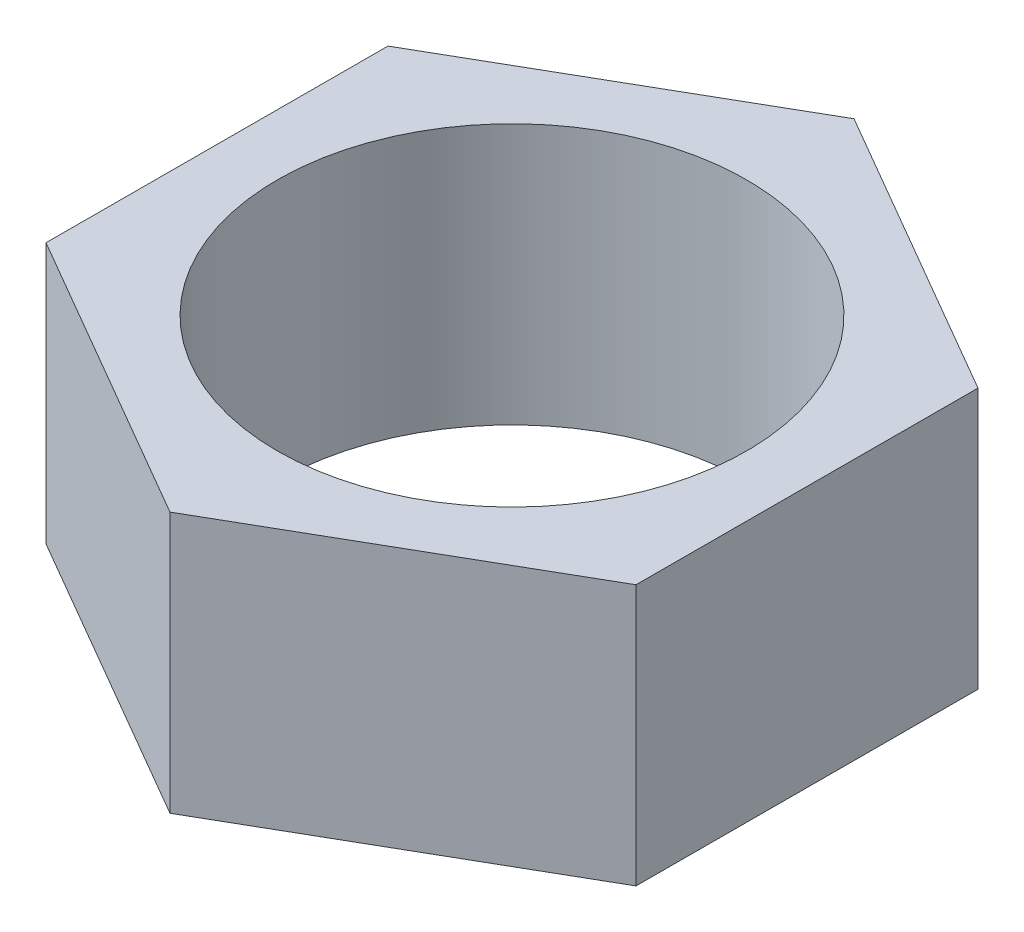
ISO-10303-21;
HEADER;
FILE_DESCRIPTION(('STEP AP214'),'2;1');
FILE_NAME('part.step','',(''),(''),'','','');
FILE_SCHEMA(('AUTOMOTIVE_DESIGN { 1 0 10303 214 1 1 1 1 }'));
ENDSEC;
DATA;
#1=APPLICATION_CONTEXT('core data for automotive mechanical design processes');
#2=APPLICATION_PROTOCOL_DEFINITION('international standard','automotive_design',2000,#1);
#3=PRODUCT_CONTEXT('',#1,'mechanical');
#4=PRODUCT('Part','Part','',(#3));
#5=PRODUCT_RELATED_PRODUCT_CATEGORY('part','',(#4));
#6=PRODUCT_DEFINITION_FORMATION('','',#4);
#7=PRODUCT_DEFINITION_CONTEXT('part definition',#1,'design');
#8=PRODUCT_DEFINITION('design','',#6,#7);
#9=PRODUCT_DEFINITION_SHAPE('','',#8);
#10=(LENGTH_UNIT() NAMED_UNIT(*) SI_UNIT(.MILLI.,.METRE.));
#11=(NAMED_UNIT(*) PLANE_ANGLE_UNIT() SI_UNIT($,.RADIAN.));
#12=(NAMED_UNIT(*) SI_UNIT($,.STERADIAN.) SOLID_ANGLE_UNIT());
#13=UNCERTAINTY_MEASURE_WITH_UNIT(LENGTH_MEASURE(1.E-05),#10,'distance_accuracy_value','');
#14=(GEOMETRIC_REPRESENTATION_CONTEXT(3) GLOBAL_UNCERTAINTY_ASSIGNED_CONTEXT((#13)) GLOBAL_UNIT_ASSIGNED_CONTEXT((#10,
#11,#12)) REPRESENTATION_CONTEXT('',''));
#15=CARTESIAN_POINT('',(0.,0.,0.));
#16=DIRECTION('',(0.,0.,1.));
#17=DIRECTION('',(1.,0.,0.));
#18=AXIS2_PLACEMENT_3D('',#15,#16,#17);
#19=CARTESIAN_POINT('',(0.,7.,0.));
#20=DIRECTION('',(0.,1.,0.));
#21=DIRECTION('',(0.,0.,1.));
#22=AXIS2_PLACEMENT_3D('',#19,#20,#21);
#23=PLANE('',#22);
#24=DIRECTION('',(0.867045332535755,0.,-0.498229255792915));
#25=VECTOR('',#24,1.);
#26=CARTESIAN_POINT('',(-0.0374364407963878,7.,18.3199617497663));
#27=LINE('',#26,#25);
#28=CARTESIAN_POINT('',(-0.0374364407963878,7.,18.3199617497663));
#29=VERTEX_POINT('',#28);
#30=CARTESIAN_POINT('',(15.8468340512586,7.,9.1924017836401));
#31=VERTEX_POINT('',#30);
#32=EDGE_CURVE('E129',#29,#31,#27,.T.);
#33=ORIENTED_EDGE('',*,*,#32,.T.);
#34=DIRECTION('',(0.00204347384259794,0.,-0.999997912105148));
#35=VECTOR('',#34,1.);
#36=CARTESIAN_POINT('',(15.8468340512586,7.,9.1924017836401));
#37=LINE('',#36,#35);
#38=CARTESIAN_POINT('',(15.884270492055,7.,-9.12755996612621));
#39=VERTEX_POINT('',#38);
#40=EDGE_CURVE('E87',#31,#39,#37,.T.);
#41=ORIENTED_EDGE('',*,*,#40,.T.);
#42=DIRECTION('',(-0.865001858693157,0.,-0.501768656312232));
#43=VECTOR('',#42,1.);
#44=CARTESIAN_POINT('',(15.884270492055,7.,-9.12755996612621));
#45=LINE('',#44,#43);
#46=CARTESIAN_POINT('',(0.037436440796386,7.,-18.3199617497663));
#47=VERTEX_POINT('',#46);
#48=EDGE_CURVE('E100',#39,#47,#45,.T.);
#49=ORIENTED_EDGE('',*,*,#48,.T.);
#50=DIRECTION('',(-0.867045332535755,0.,0.498229255792915));
#51=VECTOR('',#50,1.);
#52=CARTESIAN_POINT('',(0.037436440796386,7.,-18.3199617497663));
#53=LINE('',#52,#51);
#54=CARTESIAN_POINT('',(-15.8468340512586,7.,-9.1924017836401));
#55=VERTEX_POINT('',#54);
#56=EDGE_CURVE('E94',#47,#55,#53,.T.);
#57=ORIENTED_EDGE('',*,*,#56,.T.);
#58=DIRECTION('',(-0.00204347384259775,0.,0.999997912105148));
#59=VECTOR('',#58,1.);
#60=CARTESIAN_POINT('',(-15.8468340512586,7.,-9.1924017836401));
#61=LINE('',#60,#59);
#62=CARTESIAN_POINT('',(-15.884270492055,7.,9.12755996612621));
#63=VERTEX_POINT('',#62);
#64=EDGE_CURVE('E98',#55,#63,#61,.T.);
#65=ORIENTED_EDGE('',*,*,#64,.T.);
#66=DIRECTION('',(0.865001858693157,0.,0.501768656312232));
#67=VECTOR('',#66,1.);
#68=CARTESIAN_POINT('',(-15.884270492055,7.,9.12755996612621));
#69=LINE('',#68,#67);
#70=EDGE_CURVE('E50',#63,#29,#69,.T.);
#71=ORIENTED_EDGE('',*,*,#70,.T.);
#72=EDGE_LOOP('',(#33,#41,#49,#57,#65,#71));
#73=FACE_BOUND('',#72,.T.);
#74=CARTESIAN_POINT('',(0.,7.,0.));
#75=DIRECTION('',(0.,1.,0.));
#76=DIRECTION('',(0.,0.,1.));
#77=AXIS2_PLACEMENT_3D('',#74,#75,#76);
#78=CIRCLE('',#77,12.6);
#79=CARTESIAN_POINT('',(0.,7.,12.6));
#80=VERTEX_POINT('',#79);
#81=EDGE_CURVE('E122',#80,#80,#78,.T.);
#82=ORIENTED_EDGE('',*,*,#81,.F.);
#83=EDGE_LOOP('',(#82));
#84=FACE_BOUND('',#83,.T.);
#85=ADVANCED_FACE('F33',(#73,#84),#23,.T.);
#86=CARTESIAN_POINT('',(0.,-7.,0.));
#87=DIRECTION('',(0.,1.,0.));
#88=DIRECTION('',(0.,0.,1.));
#89=AXIS2_PLACEMENT_3D('',#86,#87,#88);
#90=PLANE('',#89);
#91=DIRECTION('',(0.867045332535755,0.,-0.498229255792915));
#92=VECTOR('',#91,1.);
#93=CARTESIAN_POINT('',(-0.0374364407963878,-7.,18.3199617497663));
#94=LINE('',#93,#92);
#95=CARTESIAN_POINT('',(-0.0374364407963878,-7.,18.3199617497663));
#96=VERTEX_POINT('',#95);
#97=CARTESIAN_POINT('',(15.8468340512586,-7.,9.1924017836401));
#98=VERTEX_POINT('',#97);
#99=EDGE_CURVE('E118',#96,#98,#94,.T.);
#100=ORIENTED_EDGE('',*,*,#99,.F.);
#101=DIRECTION('',(0.865001858693157,0.,0.501768656312232));
#102=VECTOR('',#101,1.);
#103=CARTESIAN_POINT('',(-15.884270492055,-7.,9.12755996612621));
#104=LINE('',#103,#102);
#105=CARTESIAN_POINT('',(-15.884270492055,-7.,9.12755996612621));
#106=VERTEX_POINT('',#105);
#107=EDGE_CURVE('E79',#106,#96,#104,.T.);
#108=ORIENTED_EDGE('',*,*,#107,.F.);
#109=DIRECTION('',(-0.00204347384259775,0.,0.999997912105148));
#110=VECTOR('',#109,1.);
#111=CARTESIAN_POINT('',(-15.8468340512586,-7.,-9.1924017836401));
#112=LINE('',#111,#110);
#113=CARTESIAN_POINT('',(-15.8468340512586,-7.,-9.1924017836401));
#114=VERTEX_POINT('',#113);
#115=EDGE_CURVE('E73',#114,#106,#112,.T.);
#116=ORIENTED_EDGE('',*,*,#115,.F.);
#117=DIRECTION('',(-0.867045332535755,0.,0.498229255792915));
#118=VECTOR('',#117,1.);
#119=CARTESIAN_POINT('',(0.037436440796386,-7.,-18.3199617497663));
#120=LINE('',#119,#118);
#121=CARTESIAN_POINT('',(0.037436440796386,-7.,-18.3199617497663));
#122=VERTEX_POINT('',#121);
#123=EDGE_CURVE('E108',#122,#114,#120,.T.);
#124=ORIENTED_EDGE('',*,*,#123,.F.);
#125=DIRECTION('',(-0.865001858693157,0.,-0.501768656312232));
#126=VECTOR('',#125,1.);
#127=CARTESIAN_POINT('',(15.884270492055,-7.,-9.12755996612621));
#128=LINE('',#127,#126);
#129=CARTESIAN_POINT('',(15.884270492055,-7.,-9.12755996612621));
#130=VERTEX_POINT('',#129);
#131=EDGE_CURVE('E124',#130,#122,#128,.T.);
#132=ORIENTED_EDGE('',*,*,#131,.F.);
#133=DIRECTION('',(0.00204347384259794,0.,-0.999997912105148));
#134=VECTOR('',#133,1.);
#135=CARTESIAN_POINT('',(15.8468340512586,-7.,9.1924017836401));
#136=LINE('',#135,#134);
#137=EDGE_CURVE('E121',#98,#130,#136,.T.);
#138=ORIENTED_EDGE('',*,*,#137,.F.);
#139=EDGE_LOOP('',(#100,#108,#116,#124,#132,#138));
#140=FACE_BOUND('',#139,.T.);
#141=CARTESIAN_POINT('',(0.,-7.,0.));
#142=DIRECTION('',(0.,1.,0.));
#143=DIRECTION('',(0.,0.,1.));
#144=AXIS2_PLACEMENT_3D('',#141,#142,#143);
#145=CIRCLE('',#144,12.6);
#146=CARTESIAN_POINT('',(0.,-7.,12.6));
#147=VERTEX_POINT('',#146);
#148=EDGE_CURVE('E222',#147,#147,#145,.T.);
#149=ORIENTED_EDGE('',*,*,#148,.T.);
#150=EDGE_LOOP('',(#149));
#151=FACE_BOUND('',#150,.T.);
#152=ADVANCED_FACE('F138',(#140,#151),#90,.F.);
#153=CARTESIAN_POINT('',(-0.0374364407963878,7.,18.3199617497663));
#154=DIRECTION('',(-0.498229255792915,0.,-0.867045332535755));
#155=DIRECTION('',(-0.867045332535755,0.,0.498229255792915));
#156=AXIS2_PLACEMENT_3D('',#153,#154,#155);
#157=PLANE('',#156);
#158=ORIENTED_EDGE('',*,*,#99,.T.);
#159=DIRECTION('',(0.,-1.,0.));
#160=VECTOR('',#159,1.);
#161=CARTESIAN_POINT('',(15.8468340512586,7.,9.1924017836401));
#162=LINE('',#161,#160);
#163=EDGE_CURVE('E11',#31,#98,#162,.T.);
#164=ORIENTED_EDGE('',*,*,#163,.F.);
#165=ORIENTED_EDGE('',*,*,#32,.F.);
#166=DIRECTION('',(0.,-1.,0.));
#167=VECTOR('',#166,1.);
#168=CARTESIAN_POINT('',(-0.0374364407963878,7.,18.3199617497663));
#169=LINE('',#168,#167);
#170=EDGE_CURVE('E114',#29,#96,#169,.T.);
#171=ORIENTED_EDGE('',*,*,#170,.T.);
#172=EDGE_LOOP('',(#158,#164,#165,#171));
#173=FACE_BOUND('',#172,.T.);
#174=ADVANCED_FACE('F35',(#173),#157,.F.);
#175=CARTESIAN_POINT('',(15.8468340512586,7.,9.1924017836401));
#176=DIRECTION('',(-0.999997912105148,0.,-0.00204347384259794));
#177=DIRECTION('',(-0.00204347384259794,0.,0.999997912105148));
#178=AXIS2_PLACEMENT_3D('',#175,#176,#177);
#179=PLANE('',#178);
#180=ORIENTED_EDGE('',*,*,#137,.T.);
#181=DIRECTION('',(0.,-1.,0.));
#182=VECTOR('',#181,1.);
#183=CARTESIAN_POINT('',(15.884270492055,7.,-9.12755996612621));
#184=LINE('',#183,#182);
#185=EDGE_CURVE('E42',#39,#130,#184,.T.);
#186=ORIENTED_EDGE('',*,*,#185,.F.);
#187=ORIENTED_EDGE('',*,*,#40,.F.);
#188=ORIENTED_EDGE('',*,*,#163,.T.);
#189=EDGE_LOOP('',(#180,#186,#187,#188));
#190=FACE_BOUND('',#189,.T.);
#191=ADVANCED_FACE('F163',(#190),#179,.F.);
#192=CARTESIAN_POINT('',(15.884270492055,7.,-9.12755996612621));
#193=DIRECTION('',(-0.501768656312232,0.,0.865001858693157));
#194=DIRECTION('',(0.865001858693158,0.,0.501768656312232));
#195=AXIS2_PLACEMENT_3D('',#192,#193,#194);
#196=PLANE('',#195);
#197=ORIENTED_EDGE('',*,*,#131,.T.);
#198=DIRECTION('',(0.,-1.,0.));
#199=VECTOR('',#198,1.);
#200=CARTESIAN_POINT('',(0.037436440796386,7.,-18.3199617497663));
#201=LINE('',#200,#199);
#202=EDGE_CURVE('E109',#47,#122,#201,.T.);
#203=ORIENTED_EDGE('',*,*,#202,.F.);
#204=ORIENTED_EDGE('',*,*,#48,.F.);
#205=ORIENTED_EDGE('',*,*,#185,.T.);
#206=EDGE_LOOP('',(#197,#203,#204,#205));
#207=FACE_BOUND('',#206,.T.);
#208=ADVANCED_FACE('F135',(#207),#196,.F.);
#209=CARTESIAN_POINT('',(0.037436440796386,7.,-18.3199617497663));
#210=DIRECTION('',(0.498229255792915,0.,0.867045332535755));
#211=DIRECTION('',(0.867045332535755,0.,-0.498229255792915));
#212=AXIS2_PLACEMENT_3D('',#209,#210,#211);
#213=PLANE('',#212);
#214=ORIENTED_EDGE('',*,*,#123,.T.);
#215=DIRECTION('',(0.,-1.,0.));
#216=VECTOR('',#215,1.);
#217=CARTESIAN_POINT('',(-15.8468340512586,7.,-9.1924017836401));
#218=LINE('',#217,#216);
#219=EDGE_CURVE('E105',#55,#114,#218,.T.);
#220=ORIENTED_EDGE('',*,*,#219,.F.);
#221=ORIENTED_EDGE('',*,*,#56,.F.);
#222=ORIENTED_EDGE('',*,*,#202,.T.);
#223=EDGE_LOOP('',(#214,#220,#221,#222));
#224=FACE_BOUND('',#223,.T.);
#225=ADVANCED_FACE('F106',(#224),#213,.F.);
#226=CARTESIAN_POINT('',(-15.8468340512586,7.,-9.1924017836401));
#227=DIRECTION('',(0.999997912105148,0.,0.00204347384259775));
#228=DIRECTION('',(0.00204347384259775,0.,-0.999997912105148));
#229=AXIS2_PLACEMENT_3D('',#226,#227,#228);
#230=PLANE('',#229);
#231=ORIENTED_EDGE('',*,*,#115,.T.);
#232=DIRECTION('',(0.,-1.,0.));
#233=VECTOR('',#232,1.);
#234=CARTESIAN_POINT('',(-15.884270492055,7.,9.12755996612621));
#235=LINE('',#234,#233);
#236=EDGE_CURVE('E110',#63,#106,#235,.T.);
#237=ORIENTED_EDGE('',*,*,#236,.F.);
#238=ORIENTED_EDGE('',*,*,#64,.F.);
#239=ORIENTED_EDGE('',*,*,#219,.T.);
#240=EDGE_LOOP('',(#231,#237,#238,#239));
#241=FACE_BOUND('',#240,.T.);
#242=ADVANCED_FACE('F112',(#241),#230,.F.);
#243=CARTESIAN_POINT('',(-15.884270492055,7.,9.12755996612621));
#244=DIRECTION('',(0.501768656312232,0.,-0.865001858693157));
#245=DIRECTION('',(-0.865001858693158,0.,-0.501768656312232));
#246=AXIS2_PLACEMENT_3D('',#243,#244,#245);
#247=PLANE('',#246);
#248=ORIENTED_EDGE('',*,*,#107,.T.);
#249=ORIENTED_EDGE('',*,*,#170,.F.);
#250=ORIENTED_EDGE('',*,*,#70,.F.);
#251=ORIENTED_EDGE('',*,*,#236,.T.);
#252=EDGE_LOOP('',(#248,#249,#250,#251));
#253=FACE_BOUND('',#252,.T.);
#254=ADVANCED_FACE('F143',(#253),#247,.F.);
#255=CARTESIAN_POINT('',(0.,7.,0.));
#256=DIRECTION('',(0.,-1.,0.));
#257=DIRECTION('',(0.,0.,-1.));
#258=AXIS2_PLACEMENT_3D('',#255,#256,#257);
#259=CYLINDRICAL_SURFACE('',#258,12.6);
#260=ORIENTED_EDGE('',*,*,#81,.T.);
#261=EDGE_LOOP('',(#260));
#262=FACE_BOUND('',#261,.T.);
#263=ORIENTED_EDGE('',*,*,#148,.F.);
#264=EDGE_LOOP('',(#263));
#265=FACE_BOUND('',#264,.T.);
#266=ADVANCED_FACE('F145',(#262,#265),#259,.F.);
#267=CLOSED_SHELL('',(#85,#152,#174,#191,#208,#225,#242,#254,#266));
#268=MANIFOLD_SOLID_BREP('B2',#267);
#269=ADVANCED_BREP_SHAPE_REPRESENTATION('',(#18,#268),#14);
#270=SHAPE_DEFINITION_REPRESENTATION(#9,#269);
ENDSEC;
END-ISO-10303-21;
